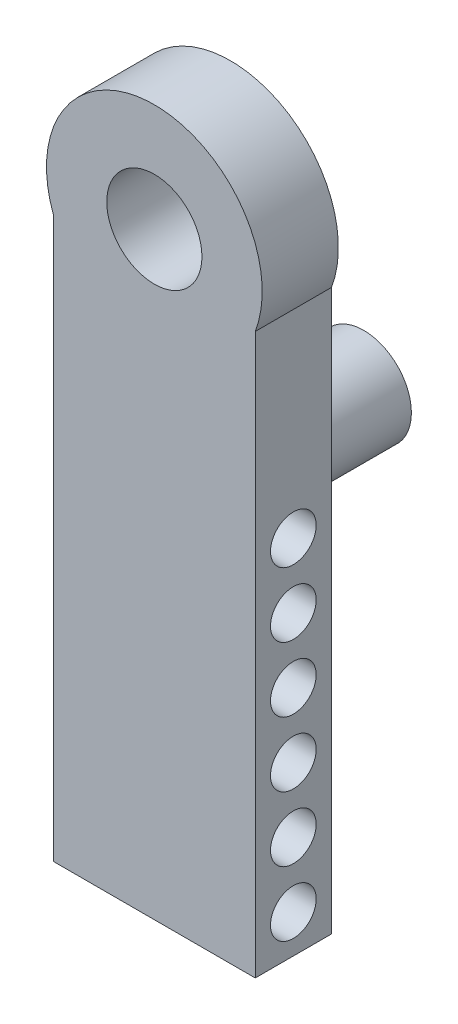
ISO-10303-21;
HEADER;
FILE_DESCRIPTION(('STEP AP214'),'2;1');
FILE_NAME('part.step','',(''),(''),'','','');
FILE_SCHEMA(('AUTOMOTIVE_DESIGN { 1 0 10303 214 1 1 1 1 }'));
ENDSEC;
DATA;
#1=APPLICATION_CONTEXT('core data for automotive mechanical design processes');
#2=APPLICATION_PROTOCOL_DEFINITION('international standard','automotive_design',2000,#1);
#3=PRODUCT_CONTEXT('',#1,'mechanical');
#4=PRODUCT('Part','Part','',(#3));
#5=PRODUCT_RELATED_PRODUCT_CATEGORY('part','',(#4));
#6=PRODUCT_DEFINITION_FORMATION('','',#4);
#7=PRODUCT_DEFINITION_CONTEXT('part definition',#1,'design');
#8=PRODUCT_DEFINITION('design','',#6,#7);
#9=PRODUCT_DEFINITION_SHAPE('','',#8);
#10=(LENGTH_UNIT() NAMED_UNIT(*) SI_UNIT(.MILLI.,.METRE.));
#11=(NAMED_UNIT(*) PLANE_ANGLE_UNIT() SI_UNIT($,.RADIAN.));
#12=(NAMED_UNIT(*) SI_UNIT($,.STERADIAN.) SOLID_ANGLE_UNIT());
#13=UNCERTAINTY_MEASURE_WITH_UNIT(LENGTH_MEASURE(1.E-05),#10,'distance_accuracy_value','');
#14=(GEOMETRIC_REPRESENTATION_CONTEXT(3) GLOBAL_UNCERTAINTY_ASSIGNED_CONTEXT((#13)) GLOBAL_UNIT_ASSIGNED_CONTEXT((#10,
#11,#12)) REPRESENTATION_CONTEXT('',''));
#15=CARTESIAN_POINT('',(0.,0.,0.));
#16=DIRECTION('',(0.,0.,1.));
#17=DIRECTION('',(1.,0.,0.));
#18=AXIS2_PLACEMENT_3D('',#15,#16,#17);
#19=CARTESIAN_POINT('',(-37.9269771858972,0.,20.));
#20=DIRECTION('',(1.,0.,0.));
#21=DIRECTION('',(0.,1.,0.));
#22=AXIS2_PLACEMENT_3D('',#19,#20,#21);
#23=PLANE('',#22);
#24=CARTESIAN_POINT('',(-37.9269771858972,-211.455871924712,10.));
#25=DIRECTION('',(1.,0.,0.));
#26=DIRECTION('',(0.,1.,0.));
#27=AXIS2_PLACEMENT_3D('',#24,#25,#26);
#28=CIRCLE('',#27,6.);
#29=CARTESIAN_POINT('',(-37.9269771858972,-205.455871924712,10.));
#30=VERTEX_POINT('',#29);
#31=EDGE_CURVE('E158',#30,#30,#28,.T.);
#32=ORIENTED_EDGE('',*,*,#31,.F.);
#33=EDGE_LOOP('',(#32));
#34=FACE_BOUND('',#33,.T.);
#35=CARTESIAN_POINT('',(-37.9269771858972,-194.455871924712,10.));
#36=DIRECTION('',(1.,0.,0.));
#37=DIRECTION('',(0.,1.,0.));
#38=AXIS2_PLACEMENT_3D('',#35,#36,#37);
#39=CIRCLE('',#38,6.);
#40=CARTESIAN_POINT('',(-37.9269771858972,-188.455871924712,10.));
#41=VERTEX_POINT('',#40);
#42=EDGE_CURVE('E129',#41,#41,#39,.T.);
#43=ORIENTED_EDGE('',*,*,#42,.F.);
#44=EDGE_LOOP('',(#43));
#45=FACE_BOUND('',#44,.T.);
#46=CARTESIAN_POINT('',(-37.9269771858972,-177.455871924712,10.));
#47=DIRECTION('',(1.,0.,0.));
#48=DIRECTION('',(0.,1.,0.));
#49=AXIS2_PLACEMENT_3D('',#46,#47,#48);
#50=CIRCLE('',#49,6.);
#51=CARTESIAN_POINT('',(-37.9269771858972,-171.455871924712,10.));
#52=VERTEX_POINT('',#51);
#53=EDGE_CURVE('E137',#52,#52,#50,.T.);
#54=ORIENTED_EDGE('',*,*,#53,.F.);
#55=EDGE_LOOP('',(#54));
#56=FACE_BOUND('',#55,.T.);
#57=CARTESIAN_POINT('',(-37.9269771858972,-160.455871924712,10.));
#58=DIRECTION('',(1.,0.,0.));
#59=DIRECTION('',(0.,1.,0.));
#60=AXIS2_PLACEMENT_3D('',#57,#58,#59);
#61=CIRCLE('',#60,6.);
#62=CARTESIAN_POINT('',(-37.9269771858972,-154.455871924712,10.));
#63=VERTEX_POINT('',#62);
#64=EDGE_CURVE('E141',#63,#63,#61,.T.);
#65=ORIENTED_EDGE('',*,*,#64,.F.);
#66=EDGE_LOOP('',(#65));
#67=FACE_BOUND('',#66,.T.);
#68=CARTESIAN_POINT('',(-37.9269771858972,-143.455871924712,10.));
#69=DIRECTION('',(1.,0.,0.));
#70=DIRECTION('',(0.,1.,0.));
#71=AXIS2_PLACEMENT_3D('',#68,#69,#70);
#72=CIRCLE('',#71,6.);
#73=CARTESIAN_POINT('',(-37.9269771858972,-137.455871924712,10.));
#74=VERTEX_POINT('',#73);
#75=EDGE_CURVE('E144',#74,#74,#72,.T.);
#76=ORIENTED_EDGE('',*,*,#75,.F.);
#77=EDGE_LOOP('',(#76));
#78=FACE_BOUND('',#77,.T.);
#79=CARTESIAN_POINT('',(-37.9269771858972,-126.455871924712,10.));
#80=DIRECTION('',(1.,0.,0.));
#81=DIRECTION('',(0.,1.,0.));
#82=AXIS2_PLACEMENT_3D('',#79,#80,#81);
#83=CIRCLE('',#82,6.);
#84=CARTESIAN_POINT('',(-37.9269771858972,-120.455871924712,10.));
#85=VERTEX_POINT('',#84);
#86=EDGE_CURVE('E148',#85,#85,#83,.T.);
#87=ORIENTED_EDGE('',*,*,#86,.F.);
#88=EDGE_LOOP('',(#87));
#89=FACE_BOUND('',#88,.T.);
#90=DIRECTION('',(0.,-1.,0.));
#91=VECTOR('',#90,1.);
#92=CARTESIAN_POINT('',(-37.9269771858972,0.,0.));
#93=LINE('',#92,#91);
#94=CARTESIAN_POINT('',(-37.9269771858972,-74.4158719247117,0.));
#95=VERTEX_POINT('',#94);
#96=CARTESIAN_POINT('',(-37.9269771858972,-221.455871924712,0.));
#97=VERTEX_POINT('',#96);
#98=EDGE_CURVE('E126',#95,#97,#93,.T.);
#99=ORIENTED_EDGE('',*,*,#98,.F.);
#100=DIRECTION('',(0.,0.,-1.));
#101=VECTOR('',#100,1.);
#102=CARTESIAN_POINT('',(-37.9269771858972,-74.4158719247117,20.));
#103=LINE('',#102,#101);
#104=CARTESIAN_POINT('',(-37.9269771858972,-74.4158719247117,20.));
#105=VERTEX_POINT('',#104);
#106=EDGE_CURVE('E11',#105,#95,#103,.T.);
#107=ORIENTED_EDGE('',*,*,#106,.F.);
#108=DIRECTION('',(0.,-1.,0.));
#109=VECTOR('',#108,1.);
#110=CARTESIAN_POINT('',(-37.9269771858972,0.,20.));
#111=LINE('',#110,#109);
#112=CARTESIAN_POINT('',(-37.9269771858972,-221.455871924712,20.));
#113=VERTEX_POINT('',#112);
#114=EDGE_CURVE('E103',#105,#113,#111,.T.);
#115=ORIENTED_EDGE('',*,*,#114,.T.);
#116=DIRECTION('',(0.,0.,-1.));
#117=VECTOR('',#116,1.);
#118=CARTESIAN_POINT('',(-37.9269771858972,-221.455871924712,20.));
#119=LINE('',#118,#117);
#120=EDGE_CURVE('E84',#113,#97,#119,.T.);
#121=ORIENTED_EDGE('',*,*,#120,.T.);
#122=EDGE_LOOP('',(#99,#107,#115,#121));
#123=FACE_BOUND('',#122,.T.);
#124=ADVANCED_FACE('F44',(#34,#45,#56,#67,#78,#89,#123),#23,.T.);
#125=CARTESIAN_POINT('',(-64.4269771858972,-64.4158719247117,20.));
#126=DIRECTION('',(0.,0.,-1.));
#127=DIRECTION('',(-1.,0.,0.));
#128=AXIS2_PLACEMENT_3D('',#125,#126,#127);
#129=CYLINDRICAL_SURFACE('',#128,28.3240180765371);
#130=CARTESIAN_POINT('',(-64.4269771858972,-64.4158719247117,0.));
#131=DIRECTION('',(0.,0.,1.));
#132=DIRECTION('',(1.,0.,0.));
#133=AXIS2_PLACEMENT_3D('',#130,#131,#132);
#134=CIRCLE('',#133,28.3240180765371);
#135=CARTESIAN_POINT('',(-90.9269771858972,-74.4158719247117,0.));
#136=VERTEX_POINT('',#135);
#137=EDGE_CURVE('E109',#95,#136,#134,.T.);
#138=ORIENTED_EDGE('',*,*,#137,.T.);
#139=DIRECTION('',(0.,0.,-1.));
#140=VECTOR('',#139,1.);
#141=CARTESIAN_POINT('',(-90.9269771858972,-74.4158719247117,20.));
#142=LINE('',#141,#140);
#143=CARTESIAN_POINT('',(-90.9269771858972,-74.4158719247117,20.));
#144=VERTEX_POINT('',#143);
#145=EDGE_CURVE('E54',#144,#136,#142,.T.);
#146=ORIENTED_EDGE('',*,*,#145,.F.);
#147=CARTESIAN_POINT('',(-64.4269771858972,-64.4158719247117,20.));
#148=DIRECTION('',(0.,0.,1.));
#149=DIRECTION('',(1.,0.,0.));
#150=AXIS2_PLACEMENT_3D('',#147,#148,#149);
#151=CIRCLE('',#150,28.3240180765371);
#152=EDGE_CURVE('E100',#105,#144,#151,.T.);
#153=ORIENTED_EDGE('',*,*,#152,.F.);
#154=ORIENTED_EDGE('',*,*,#106,.T.);
#155=EDGE_LOOP('',(#138,#146,#153,#154));
#156=FACE_BOUND('',#155,.T.);
#157=ADVANCED_FACE('F107',(#156),#129,.T.);
#158=CARTESIAN_POINT('',(-90.9269771858972,0.,20.));
#159=DIRECTION('',(1.,0.,0.));
#160=DIRECTION('',(0.,0.,-1.));
#161=AXIS2_PLACEMENT_3D('',#158,#159,#160);
#162=PLANE('',#161);
#163=CARTESIAN_POINT('',(-90.9269771858972,-211.455871924712,10.));
#164=DIRECTION('',(-1.,0.,0.));
#165=DIRECTION('',(0.,0.,1.));
#166=AXIS2_PLACEMENT_3D('',#163,#164,#165);
#167=CIRCLE('',#166,6.);
#168=CARTESIAN_POINT('',(-90.9269771858972,-211.455871924712,16.));
#169=VERTEX_POINT('',#168);
#170=EDGE_CURVE('E175',#169,#169,#167,.T.);
#171=ORIENTED_EDGE('',*,*,#170,.F.);
#172=EDGE_LOOP('',(#171));
#173=FACE_BOUND('',#172,.T.);
#174=CARTESIAN_POINT('',(-90.9269771858972,-194.455871924712,10.));
#175=DIRECTION('',(-1.,0.,0.));
#176=DIRECTION('',(0.,0.,1.));
#177=AXIS2_PLACEMENT_3D('',#174,#175,#176);
#178=CIRCLE('',#177,6.);
#179=CARTESIAN_POINT('',(-90.9269771858972,-194.455871924712,16.));
#180=VERTEX_POINT('',#179);
#181=EDGE_CURVE('E152',#180,#180,#178,.T.);
#182=ORIENTED_EDGE('',*,*,#181,.F.);
#183=EDGE_LOOP('',(#182));
#184=FACE_BOUND('',#183,.T.);
#185=CARTESIAN_POINT('',(-90.9269771858972,-177.455871924712,10.));
#186=DIRECTION('',(-1.,0.,0.));
#187=DIRECTION('',(0.,0.,1.));
#188=AXIS2_PLACEMENT_3D('',#185,#186,#187);
#189=CIRCLE('',#188,6.);
#190=CARTESIAN_POINT('',(-90.9269771858972,-177.455871924712,16.));
#191=VERTEX_POINT('',#190);
#192=EDGE_CURVE('E165',#191,#191,#189,.T.);
#193=ORIENTED_EDGE('',*,*,#192,.F.);
#194=EDGE_LOOP('',(#193));
#195=FACE_BOUND('',#194,.T.);
#196=CARTESIAN_POINT('',(-90.9269771858972,-160.455871924712,10.));
#197=DIRECTION('',(-1.,0.,0.));
#198=DIRECTION('',(0.,0.,1.));
#199=AXIS2_PLACEMENT_3D('',#196,#197,#198);
#200=CIRCLE('',#199,6.);
#201=CARTESIAN_POINT('',(-90.9269771858972,-160.455871924712,16.));
#202=VERTEX_POINT('',#201);
#203=EDGE_CURVE('E162',#202,#202,#200,.T.);
#204=ORIENTED_EDGE('',*,*,#203,.F.);
#205=EDGE_LOOP('',(#204));
#206=FACE_BOUND('',#205,.T.);
#207=CARTESIAN_POINT('',(-90.9269771858972,-143.455871924712,10.));
#208=DIRECTION('',(-1.,0.,0.));
#209=DIRECTION('',(0.,0.,1.));
#210=AXIS2_PLACEMENT_3D('',#207,#208,#209);
#211=CIRCLE('',#210,6.);
#212=CARTESIAN_POINT('',(-90.9269771858972,-143.455871924712,16.));
#213=VERTEX_POINT('',#212);
#214=EDGE_CURVE('E157',#213,#213,#211,.T.);
#215=ORIENTED_EDGE('',*,*,#214,.F.);
#216=EDGE_LOOP('',(#215));
#217=FACE_BOUND('',#216,.T.);
#218=CARTESIAN_POINT('',(-90.9269771858972,-126.455871924712,10.));
#219=DIRECTION('',(-1.,0.,0.));
#220=DIRECTION('',(0.,0.,1.));
#221=AXIS2_PLACEMENT_3D('',#218,#219,#220);
#222=CIRCLE('',#221,6.);
#223=CARTESIAN_POINT('',(-90.9269771858972,-126.455871924712,16.));
#224=VERTEX_POINT('',#223);
#225=EDGE_CURVE('E153',#224,#224,#222,.T.);
#226=ORIENTED_EDGE('',*,*,#225,.F.);
#227=EDGE_LOOP('',(#226));
#228=FACE_BOUND('',#227,.T.);
#229=DIRECTION('',(0.,-1.,0.));
#230=VECTOR('',#229,1.);
#231=CARTESIAN_POINT('',(-90.9269771858972,0.,0.));
#232=LINE('',#231,#230);
#233=CARTESIAN_POINT('',(-90.9269771858972,-221.455871924712,0.));
#234=VERTEX_POINT('',#233);
#235=EDGE_CURVE('E121',#136,#234,#232,.T.);
#236=ORIENTED_EDGE('',*,*,#235,.T.);
#237=DIRECTION('',(0.,0.,-1.));
#238=VECTOR('',#237,1.);
#239=CARTESIAN_POINT('',(-90.9269771858972,-221.455871924712,20.));
#240=LINE('',#239,#238);
#241=CARTESIAN_POINT('',(-90.9269771858972,-221.455871924712,20.));
#242=VERTEX_POINT('',#241);
#243=EDGE_CURVE('E98',#242,#234,#240,.T.);
#244=ORIENTED_EDGE('',*,*,#243,.F.);
#245=DIRECTION('',(0.,-1.,0.));
#246=VECTOR('',#245,1.);
#247=CARTESIAN_POINT('',(-90.9269771858972,0.,20.));
#248=LINE('',#247,#246);
#249=EDGE_CURVE('E92',#144,#242,#248,.T.);
#250=ORIENTED_EDGE('',*,*,#249,.F.);
#251=ORIENTED_EDGE('',*,*,#145,.T.);
#252=EDGE_LOOP('',(#236,#244,#250,#251));
#253=FACE_BOUND('',#252,.T.);
#254=ADVANCED_FACE('F95',(#173,#184,#195,#206,#217,#228,#253),#162,.F.);
#255=CARTESIAN_POINT('',(0.,-221.455871924712,20.));
#256=DIRECTION('',(0.,1.,0.));
#257=DIRECTION('',(0.,0.,1.));
#258=AXIS2_PLACEMENT_3D('',#255,#256,#257);
#259=PLANE('',#258);
#260=DIRECTION('',(1.,0.,0.));
#261=VECTOR('',#260,1.);
#262=CARTESIAN_POINT('',(0.,-221.455871924712,0.));
#263=LINE('',#262,#261);
#264=EDGE_CURVE('E77',#234,#97,#263,.T.);
#265=ORIENTED_EDGE('',*,*,#264,.T.);
#266=ORIENTED_EDGE('',*,*,#120,.F.);
#267=DIRECTION('',(1.,0.,0.));
#268=VECTOR('',#267,1.);
#269=CARTESIAN_POINT('',(0.,-221.455871924712,20.));
#270=LINE('',#269,#268);
#271=EDGE_CURVE('E62',#242,#113,#270,.T.);
#272=ORIENTED_EDGE('',*,*,#271,.F.);
#273=ORIENTED_EDGE('',*,*,#243,.T.);
#274=EDGE_LOOP('',(#265,#266,#272,#273));
#275=FACE_BOUND('',#274,.T.);
#276=ADVANCED_FACE('F231',(#275),#259,.F.);
#277=CARTESIAN_POINT('',(0.,0.,20.));
#278=DIRECTION('',(0.,0.,1.));
#279=DIRECTION('',(1.,0.,0.));
#280=AXIS2_PLACEMENT_3D('',#277,#278,#279);
#281=PLANE('',#280);
#282=CARTESIAN_POINT('',(-64.4269771858972,-64.4158719247117,20.));
#283=DIRECTION('',(0.,0.,1.));
#284=DIRECTION('',(1.,0.,0.));
#285=AXIS2_PLACEMENT_3D('',#282,#283,#284);
#286=CIRCLE('',#285,12.5);
#287=CARTESIAN_POINT('',(-51.9269771858972,-64.4158719247117,20.));
#288=VERTEX_POINT('',#287);
#289=EDGE_CURVE('E179',#288,#288,#286,.T.);
#290=ORIENTED_EDGE('',*,*,#289,.F.);
#291=EDGE_LOOP('',(#290));
#292=FACE_BOUND('',#291,.T.);
#293=ORIENTED_EDGE('',*,*,#114,.F.);
#294=ORIENTED_EDGE('',*,*,#152,.T.);
#295=ORIENTED_EDGE('',*,*,#249,.T.);
#296=ORIENTED_EDGE('',*,*,#271,.T.);
#297=EDGE_LOOP('',(#293,#294,#295,#296));
#298=FACE_BOUND('',#297,.T.);
#299=ADVANCED_FACE('F102',(#292,#298),#281,.T.);
#300=CARTESIAN_POINT('',(0.,0.,0.));
#301=DIRECTION('',(0.,0.,1.));
#302=DIRECTION('',(1.,0.,0.));
#303=AXIS2_PLACEMENT_3D('',#300,#301,#302);
#304=PLANE('',#303);
#305=CARTESIAN_POINT('',(-64.4269771858972,-127.415871924712,0.));
#306=DIRECTION('',(0.,0.,1.));
#307=DIRECTION('',(1.,0.,0.));
#308=AXIS2_PLACEMENT_3D('',#305,#306,#307);
#309=CIRCLE('',#308,12.5);
#310=CARTESIAN_POINT('',(-51.9269771858972,-127.415871924712,0.));
#311=VERTEX_POINT('',#310);
#312=EDGE_CURVE('E184',#311,#311,#309,.T.);
#313=ORIENTED_EDGE('',*,*,#312,.T.);
#314=EDGE_LOOP('',(#313));
#315=FACE_BOUND('',#314,.T.);
#316=CARTESIAN_POINT('',(-64.4269771858972,-64.4158719247117,0.));
#317=DIRECTION('',(0.,0.,1.));
#318=DIRECTION('',(1.,0.,0.));
#319=AXIS2_PLACEMENT_3D('',#316,#317,#318);
#320=CIRCLE('',#319,12.5);
#321=CARTESIAN_POINT('',(-51.9269771858972,-64.4158719247117,0.));
#322=VERTEX_POINT('',#321);
#323=EDGE_CURVE('E47',#322,#322,#320,.T.);
#324=ORIENTED_EDGE('',*,*,#323,.T.);
#325=EDGE_LOOP('',(#324));
#326=FACE_BOUND('',#325,.T.);
#327=ORIENTED_EDGE('',*,*,#98,.T.);
#328=ORIENTED_EDGE('',*,*,#264,.F.);
#329=ORIENTED_EDGE('',*,*,#235,.F.);
#330=ORIENTED_EDGE('',*,*,#137,.F.);
#331=EDGE_LOOP('',(#327,#328,#329,#330));
#332=FACE_BOUND('',#331,.T.);
#333=ADVANCED_FACE('F219',(#315,#326,#332),#304,.F.);
#334=CARTESIAN_POINT('',(-36.1029591093601,-126.455871924712,10.));
#335=DIRECTION('',(-1.,0.,0.));
#336=DIRECTION('',(0.,0.,1.));
#337=AXIS2_PLACEMENT_3D('',#334,#335,#336);
#338=CYLINDRICAL_SURFACE('',#337,6.);
#339=ORIENTED_EDGE('',*,*,#86,.T.);
#340=EDGE_LOOP('',(#339));
#341=FACE_BOUND('',#340,.T.);
#342=ORIENTED_EDGE('',*,*,#225,.T.);
#343=EDGE_LOOP('',(#342));
#344=FACE_BOUND('',#343,.T.);
#345=ADVANCED_FACE('F221',(#341,#344),#338,.F.);
#346=CARTESIAN_POINT('',(-36.1029591093601,-143.455871924712,10.));
#347=DIRECTION('',(-1.,0.,0.));
#348=DIRECTION('',(0.,0.,1.));
#349=AXIS2_PLACEMENT_3D('',#346,#347,#348);
#350=CYLINDRICAL_SURFACE('',#349,6.);
#351=ORIENTED_EDGE('',*,*,#75,.T.);
#352=EDGE_LOOP('',(#351));
#353=FACE_BOUND('',#352,.T.);
#354=ORIENTED_EDGE('',*,*,#214,.T.);
#355=EDGE_LOOP('',(#354));
#356=FACE_BOUND('',#355,.T.);
#357=ADVANCED_FACE('F228',(#353,#356),#350,.F.);
#358=CARTESIAN_POINT('',(-36.1029591093601,-160.455871924712,10.));
#359=DIRECTION('',(-1.,0.,0.));
#360=DIRECTION('',(0.,0.,1.));
#361=AXIS2_PLACEMENT_3D('',#358,#359,#360);
#362=CYLINDRICAL_SURFACE('',#361,6.);
#363=ORIENTED_EDGE('',*,*,#64,.T.);
#364=EDGE_LOOP('',(#363));
#365=FACE_BOUND('',#364,.T.);
#366=ORIENTED_EDGE('',*,*,#203,.T.);
#367=EDGE_LOOP('',(#366));
#368=FACE_BOUND('',#367,.T.);
#369=ADVANCED_FACE('F257',(#365,#368),#362,.F.);
#370=CARTESIAN_POINT('',(-36.1029591093601,-177.455871924712,10.));
#371=DIRECTION('',(-1.,0.,0.));
#372=DIRECTION('',(0.,0.,1.));
#373=AXIS2_PLACEMENT_3D('',#370,#371,#372);
#374=CYLINDRICAL_SURFACE('',#373,6.);
#375=ORIENTED_EDGE('',*,*,#53,.T.);
#376=EDGE_LOOP('',(#375));
#377=FACE_BOUND('',#376,.T.);
#378=ORIENTED_EDGE('',*,*,#192,.T.);
#379=EDGE_LOOP('',(#378));
#380=FACE_BOUND('',#379,.T.);
#381=ADVANCED_FACE('F263',(#377,#380),#374,.F.);
#382=CARTESIAN_POINT('',(-36.1029591093601,-194.455871924712,10.));
#383=DIRECTION('',(-1.,0.,0.));
#384=DIRECTION('',(0.,0.,1.));
#385=AXIS2_PLACEMENT_3D('',#382,#383,#384);
#386=CYLINDRICAL_SURFACE('',#385,6.);
#387=ORIENTED_EDGE('',*,*,#42,.T.);
#388=EDGE_LOOP('',(#387));
#389=FACE_BOUND('',#388,.T.);
#390=ORIENTED_EDGE('',*,*,#181,.T.);
#391=EDGE_LOOP('',(#390));
#392=FACE_BOUND('',#391,.T.);
#393=ADVANCED_FACE('F269',(#389,#392),#386,.F.);
#394=CARTESIAN_POINT('',(-36.1029591093601,-211.455871924712,10.));
#395=DIRECTION('',(-1.,0.,0.));
#396=DIRECTION('',(0.,0.,1.));
#397=AXIS2_PLACEMENT_3D('',#394,#395,#396);
#398=CYLINDRICAL_SURFACE('',#397,6.);
#399=ORIENTED_EDGE('',*,*,#31,.T.);
#400=EDGE_LOOP('',(#399));
#401=FACE_BOUND('',#400,.T.);
#402=ORIENTED_EDGE('',*,*,#170,.T.);
#403=EDGE_LOOP('',(#402));
#404=FACE_BOUND('',#403,.T.);
#405=ADVANCED_FACE('F273',(#401,#404),#398,.F.);
#406=CARTESIAN_POINT('',(-64.4269771858972,-64.4158719247117,-3.));
#407=DIRECTION('',(0.,0.,1.));
#408=DIRECTION('',(1.,0.,0.));
#409=AXIS2_PLACEMENT_3D('',#406,#407,#408);
#410=CYLINDRICAL_SURFACE('',#409,12.5);
#411=ORIENTED_EDGE('',*,*,#289,.T.);
#412=EDGE_LOOP('',(#411));
#413=FACE_BOUND('',#412,.T.);
#414=ORIENTED_EDGE('',*,*,#323,.F.);
#415=EDGE_LOOP('',(#414));
#416=FACE_BOUND('',#415,.T.);
#417=ADVANCED_FACE('F201',(#413,#416),#410,.F.);
#418=CARTESIAN_POINT('',(-64.4269771858972,-127.415871924712,-35.));
#419=DIRECTION('',(0.,0.,1.));
#420=DIRECTION('',(1.,0.,0.));
#421=AXIS2_PLACEMENT_3D('',#418,#419,#420);
#422=CYLINDRICAL_SURFACE('',#421,12.5);
#423=CARTESIAN_POINT('',(-64.4269771858972,-127.415871924712,-35.));
#424=DIRECTION('',(0.,0.,1.));
#425=DIRECTION('',(1.,0.,0.));
#426=AXIS2_PLACEMENT_3D('',#423,#424,#425);
#427=CIRCLE('',#426,12.5);
#428=CARTESIAN_POINT('',(-51.9269771858972,-127.415871924712,-35.));
#429=VERTEX_POINT('',#428);
#430=EDGE_CURVE('E183',#429,#429,#427,.T.);
#431=ORIENTED_EDGE('',*,*,#430,.T.);
#432=EDGE_LOOP('',(#431));
#433=FACE_BOUND('',#432,.T.);
#434=ORIENTED_EDGE('',*,*,#312,.F.);
#435=EDGE_LOOP('',(#434));
#436=FACE_BOUND('',#435,.T.);
#437=ADVANCED_FACE('F192',(#433,#436),#422,.T.);
#438=CARTESIAN_POINT('',(0.,0.,-35.));
#439=DIRECTION('',(0.,0.,1.));
#440=DIRECTION('',(1.,0.,0.));
#441=AXIS2_PLACEMENT_3D('',#438,#439,#440);
#442=PLANE('',#441);
#443=ORIENTED_EDGE('',*,*,#430,.F.);
#444=EDGE_LOOP('',(#443));
#445=FACE_BOUND('',#444,.T.);
#446=ADVANCED_FACE('F195',(#445),#442,.F.);
#447=CLOSED_SHELL('',(#124,#157,#254,#276,#299,#333,#345,#357,#369,#381,#393,#405,#417,#437,#446));
#448=MANIFOLD_SOLID_BREP('B2',#447);
#449=ADVANCED_BREP_SHAPE_REPRESENTATION('',(#18,#448),#14);
#450=SHAPE_DEFINITION_REPRESENTATION(#9,#449);
ENDSEC;
END-ISO-10303-21;
